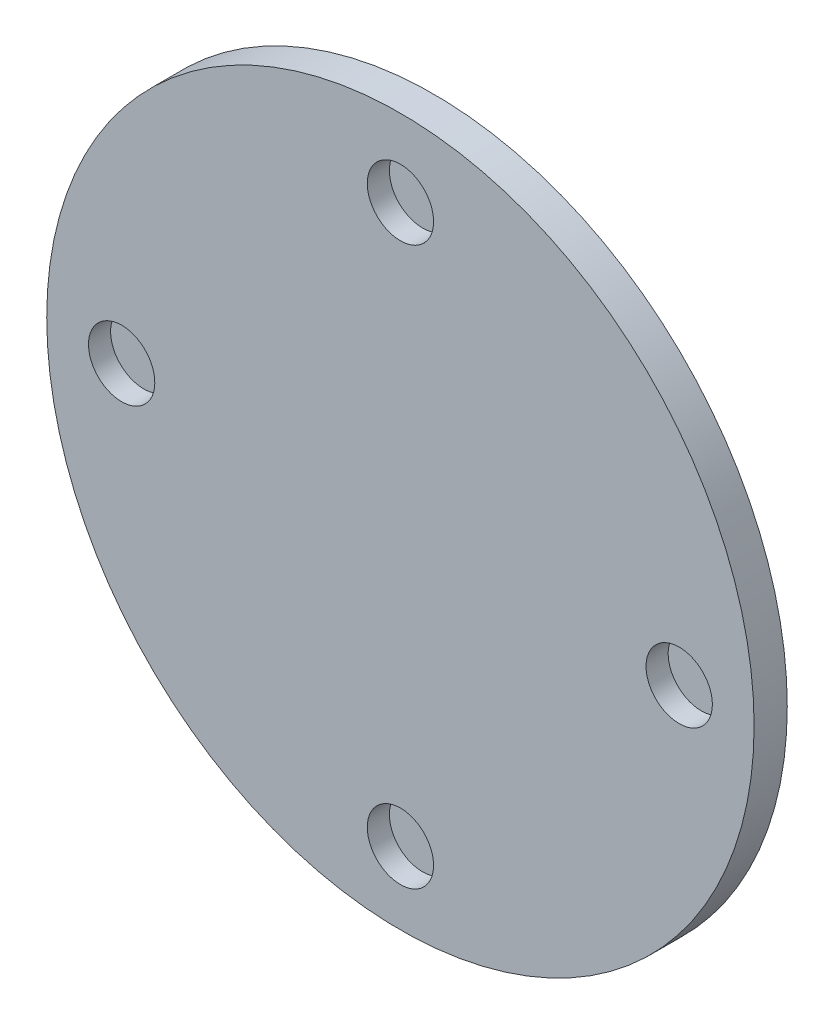
ISO-10303-21;
HEADER;
FILE_DESCRIPTION(('STEP AP214'),'2;1');
FILE_NAME('part.step','',(''),(''),'','','');
FILE_SCHEMA(('AUTOMOTIVE_DESIGN { 1 0 10303 214 1 1 1 1 }'));
ENDSEC;
DATA;
#1=APPLICATION_CONTEXT('core data for automotive mechanical design processes');
#2=APPLICATION_PROTOCOL_DEFINITION('international standard','automotive_design',2000,#1);
#3=PRODUCT_CONTEXT('',#1,'mechanical');
#4=PRODUCT('Part','Part','',(#3));
#5=PRODUCT_RELATED_PRODUCT_CATEGORY('part','',(#4));
#6=PRODUCT_DEFINITION_FORMATION('','',#4);
#7=PRODUCT_DEFINITION_CONTEXT('part definition',#1,'design');
#8=PRODUCT_DEFINITION('design','',#6,#7);
#9=PRODUCT_DEFINITION_SHAPE('','',#8);
#10=(LENGTH_UNIT() NAMED_UNIT(*) SI_UNIT(.MILLI.,.METRE.));
#11=(NAMED_UNIT(*) PLANE_ANGLE_UNIT() SI_UNIT($,.RADIAN.));
#12=(NAMED_UNIT(*) SI_UNIT($,.STERADIAN.) SOLID_ANGLE_UNIT());
#13=UNCERTAINTY_MEASURE_WITH_UNIT(LENGTH_MEASURE(1.E-05),#10,'distance_accuracy_value','');
#14=(GEOMETRIC_REPRESENTATION_CONTEXT(3) GLOBAL_UNCERTAINTY_ASSIGNED_CONTEXT((#13)) GLOBAL_UNIT_ASSIGNED_CONTEXT((#10,
#11,#12)) REPRESENTATION_CONTEXT('',''));
#15=CARTESIAN_POINT('',(0.,0.,0.));
#16=DIRECTION('',(0.,0.,1.));
#17=DIRECTION('',(1.,0.,0.));
#18=AXIS2_PLACEMENT_3D('',#15,#16,#17);
#19=CARTESIAN_POINT('',(0.,0.,-1.5));
#20=DIRECTION('',(0.,0.,1.));
#21=DIRECTION('',(1.,0.,0.));
#22=AXIS2_PLACEMENT_3D('',#19,#20,#21);
#23=CYLINDRICAL_SURFACE('',#22,16.);
#24=CARTESIAN_POINT('',(0.,0.,-1.5));
#25=DIRECTION('',(0.,0.,1.));
#26=DIRECTION('',(1.,0.,0.));
#27=AXIS2_PLACEMENT_3D('',#24,#25,#26);
#28=CIRCLE('',#27,16.);
#29=CARTESIAN_POINT('',(16.,0.,-1.5));
#30=VERTEX_POINT('',#29);
#31=EDGE_CURVE('E10',#30,#30,#28,.T.);
#32=ORIENTED_EDGE('',*,*,#31,.T.);
#33=EDGE_LOOP('',(#32));
#34=FACE_BOUND('',#33,.T.);
#35=CARTESIAN_POINT('',(0.,0.,0.));
#36=DIRECTION('',(0.,0.,1.));
#37=DIRECTION('',(1.,0.,0.));
#38=AXIS2_PLACEMENT_3D('',#35,#36,#37);
#39=CIRCLE('',#38,16.);
#40=CARTESIAN_POINT('',(16.,0.,0.));
#41=VERTEX_POINT('',#40);
#42=EDGE_CURVE('E39',#41,#41,#39,.T.);
#43=ORIENTED_EDGE('',*,*,#42,.F.);
#44=EDGE_LOOP('',(#43));
#45=FACE_BOUND('',#44,.T.);
#46=ADVANCED_FACE('F36',(#34,#45),#23,.T.);
#47=CARTESIAN_POINT('',(0.,0.,-1.5));
#48=DIRECTION('',(0.,0.,1.));
#49=DIRECTION('',(1.,0.,0.));
#50=AXIS2_PLACEMENT_3D('',#47,#48,#49);
#51=PLANE('',#50);
#52=ORIENTED_EDGE('',*,*,#31,.F.);
#53=EDGE_LOOP('',(#52));
#54=FACE_BOUND('',#53,.T.);
#55=ADVANCED_FACE('F95',(#54),#51,.F.);
#56=CARTESIAN_POINT('',(0.,0.,0.));
#57=DIRECTION('',(0.,0.,1.));
#58=DIRECTION('',(1.,0.,0.));
#59=AXIS2_PLACEMENT_3D('',#56,#57,#58);
#60=PLANE('',#59);
#61=CARTESIAN_POINT('',(-12.6108374384236,-0.110837438423693,0.));
#62=DIRECTION('',(0.,0.,1.));
#63=DIRECTION('',(0.,1.,0.));
#64=AXIS2_PLACEMENT_3D('',#61,#62,#63);
#65=CIRCLE('',#64,1.5);
#66=CARTESIAN_POINT('',(-12.6108374384236,1.38916256157631,0.));
#67=VERTEX_POINT('',#66);
#68=EDGE_CURVE('E74',#67,#67,#65,.T.);
#69=ORIENTED_EDGE('',*,*,#68,.F.);
#70=EDGE_LOOP('',(#69));
#71=FACE_BOUND('',#70,.T.);
#72=CARTESIAN_POINT('',(0.,-12.7216748768473,0.));
#73=DIRECTION('',(0.,0.,1.));
#74=DIRECTION('',(-1.,0.,0.));
#75=AXIS2_PLACEMENT_3D('',#72,#73,#74);
#76=CIRCLE('',#75,1.5);
#77=CARTESIAN_POINT('',(-1.49999999999999,-12.7216748768473,0.));
#78=VERTEX_POINT('',#77);
#79=EDGE_CURVE('E66',#78,#78,#76,.T.);
#80=ORIENTED_EDGE('',*,*,#79,.F.);
#81=EDGE_LOOP('',(#80));
#82=FACE_BOUND('',#81,.T.);
#83=CARTESIAN_POINT('',(12.6108374384236,-0.110837438423509,0.));
#84=DIRECTION('',(0.,0.,1.));
#85=DIRECTION('',(0.,-1.,0.));
#86=AXIS2_PLACEMENT_3D('',#83,#84,#85);
#87=CIRCLE('',#86,1.5);
#88=CARTESIAN_POINT('',(12.6108374384237,-1.61083743842351,0.));
#89=VERTEX_POINT('',#88);
#90=EDGE_CURVE('E58',#89,#89,#87,.T.);
#91=ORIENTED_EDGE('',*,*,#90,.F.);
#92=EDGE_LOOP('',(#91));
#93=FACE_BOUND('',#92,.T.);
#94=CARTESIAN_POINT('',(0.,12.5,0.));
#95=DIRECTION('',(0.,0.,1.));
#96=DIRECTION('',(1.,0.,0.));
#97=AXIS2_PLACEMENT_3D('',#94,#95,#96);
#98=CIRCLE('',#97,1.5);
#99=CARTESIAN_POINT('',(1.5,12.5,0.));
#100=VERTEX_POINT('',#99);
#101=EDGE_CURVE('E50',#100,#100,#98,.T.);
#102=ORIENTED_EDGE('',*,*,#101,.F.);
#103=EDGE_LOOP('',(#102));
#104=FACE_BOUND('',#103,.T.);
#105=ORIENTED_EDGE('',*,*,#42,.T.);
#106=EDGE_LOOP('',(#105));
#107=FACE_BOUND('',#106,.T.);
#108=ADVANCED_FACE('F91',(#71,#82,#93,#104,#107),#60,.T.);
#109=CARTESIAN_POINT('',(0.,12.5,-1.));
#110=DIRECTION('',(0.,0.,1.));
#111=DIRECTION('',(1.,0.,0.));
#112=AXIS2_PLACEMENT_3D('',#109,#110,#111);
#113=CYLINDRICAL_SURFACE('',#112,1.5);
#114=CARTESIAN_POINT('',(0.,12.5,-1.));
#115=DIRECTION('',(0.,0.,1.));
#116=DIRECTION('',(1.,0.,0.));
#117=AXIS2_PLACEMENT_3D('',#114,#115,#116);
#118=CIRCLE('',#117,1.5);
#119=CARTESIAN_POINT('',(1.5,12.5,-1.));
#120=VERTEX_POINT('',#119);
#121=EDGE_CURVE('E48',#120,#120,#118,.T.);
#122=ORIENTED_EDGE('',*,*,#121,.F.);
#123=EDGE_LOOP('',(#122));
#124=FACE_BOUND('',#123,.T.);
#125=ORIENTED_EDGE('',*,*,#101,.T.);
#126=EDGE_LOOP('',(#125));
#127=FACE_BOUND('',#126,.T.);
#128=ADVANCED_FACE('F94',(#124,#127),#113,.F.);
#129=CARTESIAN_POINT('',(0.,12.5,-1.));
#130=DIRECTION('',(0.,0.,1.));
#131=DIRECTION('',(1.,0.,0.));
#132=AXIS2_PLACEMENT_3D('',#129,#130,#131);
#133=PLANE('',#132);
#134=ORIENTED_EDGE('',*,*,#121,.T.);
#135=EDGE_LOOP('',(#134));
#136=FACE_BOUND('',#135,.T.);
#137=ADVANCED_FACE('F116',(#136),#133,.T.);
#138=CARTESIAN_POINT('',(12.6108374384236,-0.110837438423509,-1.));
#139=DIRECTION('',(0.,0.,1.));
#140=DIRECTION('',(1.,0.,0.));
#141=AXIS2_PLACEMENT_3D('',#138,#139,#140);
#142=CYLINDRICAL_SURFACE('',#141,1.5);
#143=CARTESIAN_POINT('',(12.6108374384236,-0.110837438423509,-1.));
#144=DIRECTION('',(0.,0.,1.));
#145=DIRECTION('',(0.,-1.,0.));
#146=AXIS2_PLACEMENT_3D('',#143,#144,#145);
#147=CIRCLE('',#146,1.5);
#148=CARTESIAN_POINT('',(12.6108374384237,-1.61083743842351,-1.));
#149=VERTEX_POINT('',#148);
#150=EDGE_CURVE('E62',#149,#149,#147,.T.);
#151=ORIENTED_EDGE('',*,*,#150,.F.);
#152=EDGE_LOOP('',(#151));
#153=FACE_BOUND('',#152,.T.);
#154=ORIENTED_EDGE('',*,*,#90,.T.);
#155=EDGE_LOOP('',(#154));
#156=FACE_BOUND('',#155,.T.);
#157=ADVANCED_FACE('F120',(#153,#156),#142,.F.);
#158=CARTESIAN_POINT('',(12.6108374384236,-0.110837438423509,-1.));
#159=DIRECTION('',(0.,0.,1.));
#160=DIRECTION('',(0.,-1.,0.));
#161=AXIS2_PLACEMENT_3D('',#158,#159,#160);
#162=PLANE('',#161);
#163=ORIENTED_EDGE('',*,*,#150,.T.);
#164=EDGE_LOOP('',(#163));
#165=FACE_BOUND('',#164,.T.);
#166=ADVANCED_FACE('F124',(#165),#162,.T.);
#167=CARTESIAN_POINT('',(0.,-12.7216748768473,-1.));
#168=DIRECTION('',(0.,0.,1.));
#169=DIRECTION('',(1.,0.,0.));
#170=AXIS2_PLACEMENT_3D('',#167,#168,#169);
#171=CYLINDRICAL_SURFACE('',#170,1.5);
#172=CARTESIAN_POINT('',(0.,-12.7216748768473,-1.));
#173=DIRECTION('',(0.,0.,1.));
#174=DIRECTION('',(-1.,0.,0.));
#175=AXIS2_PLACEMENT_3D('',#172,#173,#174);
#176=CIRCLE('',#175,1.5);
#177=CARTESIAN_POINT('',(-1.49999999999999,-12.7216748768473,-1.));
#178=VERTEX_POINT('',#177);
#179=EDGE_CURVE('E70',#178,#178,#176,.T.);
#180=ORIENTED_EDGE('',*,*,#179,.F.);
#181=EDGE_LOOP('',(#180));
#182=FACE_BOUND('',#181,.T.);
#183=ORIENTED_EDGE('',*,*,#79,.T.);
#184=EDGE_LOOP('',(#183));
#185=FACE_BOUND('',#184,.T.);
#186=ADVANCED_FACE('F128',(#182,#185),#171,.F.);
#187=CARTESIAN_POINT('',(0.,-12.7216748768473,-1.));
#188=DIRECTION('',(0.,0.,1.));
#189=DIRECTION('',(-1.,0.,0.));
#190=AXIS2_PLACEMENT_3D('',#187,#188,#189);
#191=PLANE('',#190);
#192=ORIENTED_EDGE('',*,*,#179,.T.);
#193=EDGE_LOOP('',(#192));
#194=FACE_BOUND('',#193,.T.);
#195=ADVANCED_FACE('F87',(#194),#191,.T.);
#196=CARTESIAN_POINT('',(-12.6108374384236,-0.110837438423693,-1.));
#197=DIRECTION('',(0.,0.,1.));
#198=DIRECTION('',(1.,0.,0.));
#199=AXIS2_PLACEMENT_3D('',#196,#197,#198);
#200=CYLINDRICAL_SURFACE('',#199,1.5);
#201=CARTESIAN_POINT('',(-12.6108374384236,-0.110837438423693,-1.));
#202=DIRECTION('',(0.,0.,1.));
#203=DIRECTION('',(0.,1.,0.));
#204=AXIS2_PLACEMENT_3D('',#201,#202,#203);
#205=CIRCLE('',#204,1.5);
#206=CARTESIAN_POINT('',(-12.6108374384236,1.38916256157631,-1.));
#207=VERTEX_POINT('',#206);
#208=EDGE_CURVE('E54',#207,#207,#205,.T.);
#209=ORIENTED_EDGE('',*,*,#208,.F.);
#210=EDGE_LOOP('',(#209));
#211=FACE_BOUND('',#210,.T.);
#212=ORIENTED_EDGE('',*,*,#68,.T.);
#213=EDGE_LOOP('',(#212));
#214=FACE_BOUND('',#213,.T.);
#215=ADVANCED_FACE('F84',(#211,#214),#200,.F.);
#216=CARTESIAN_POINT('',(-12.6108374384236,-0.110837438423693,-1.));
#217=DIRECTION('',(0.,0.,1.));
#218=DIRECTION('',(0.,1.,0.));
#219=AXIS2_PLACEMENT_3D('',#216,#217,#218);
#220=PLANE('',#219);
#221=ORIENTED_EDGE('',*,*,#208,.T.);
#222=EDGE_LOOP('',(#221));
#223=FACE_BOUND('',#222,.T.);
#224=ADVANCED_FACE('F82',(#223),#220,.T.);
#225=CLOSED_SHELL('',(#46,#55,#108,#128,#137,#157,#166,#186,#195,#215,#224));
#226=MANIFOLD_SOLID_BREP('B2',#225);
#227=ADVANCED_BREP_SHAPE_REPRESENTATION('',(#18,#226),#14);
#228=SHAPE_DEFINITION_REPRESENTATION(#9,#227);
ENDSEC;
END-ISO-10303-21;
